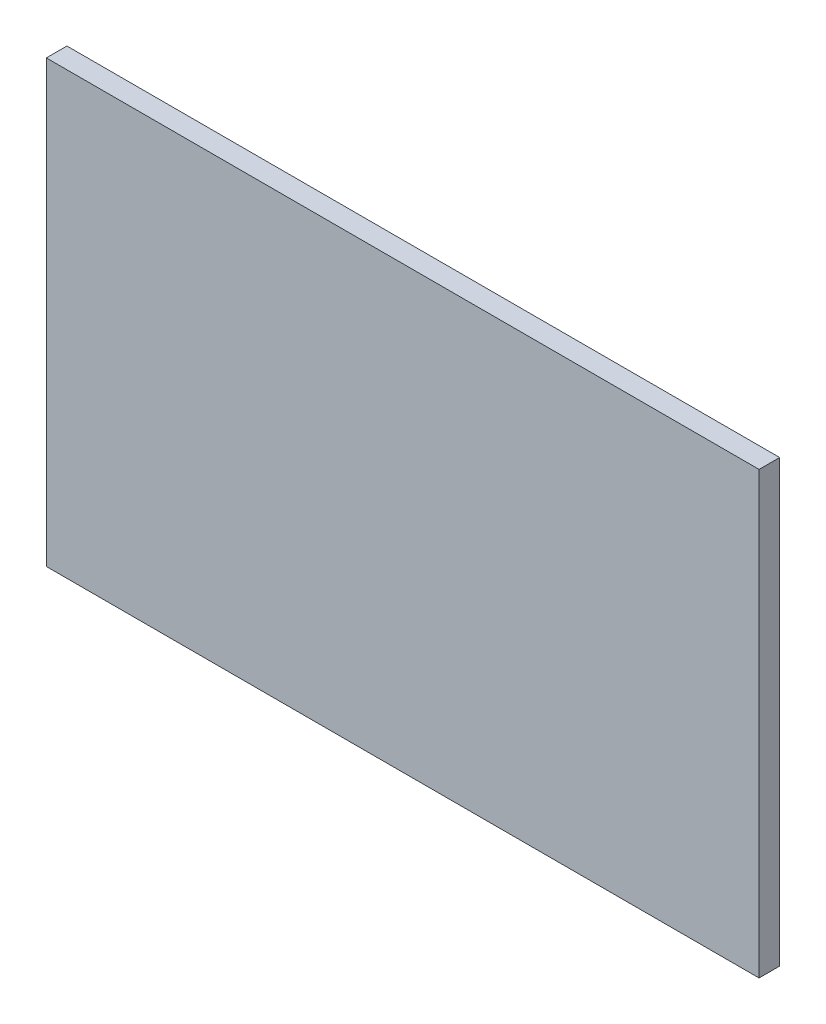
ISO-10303-21;
HEADER;
FILE_DESCRIPTION(('STEP AP214'),'2;1');
FILE_NAME('part.step','',(''),(''),'','','');
FILE_SCHEMA(('AUTOMOTIVE_DESIGN { 1 0 10303 214 1 1 1 1 }'));
ENDSEC;
DATA;
#1=APPLICATION_CONTEXT('core data for automotive mechanical design processes');
#2=APPLICATION_PROTOCOL_DEFINITION('international standard','automotive_design',2000,#1);
#3=PRODUCT_CONTEXT('',#1,'mechanical');
#4=PRODUCT('Part','Part','',(#3));
#5=PRODUCT_RELATED_PRODUCT_CATEGORY('part','',(#4));
#6=PRODUCT_DEFINITION_FORMATION('','',#4);
#7=PRODUCT_DEFINITION_CONTEXT('part definition',#1,'design');
#8=PRODUCT_DEFINITION('design','',#6,#7);
#9=PRODUCT_DEFINITION_SHAPE('','',#8);
#10=(LENGTH_UNIT() NAMED_UNIT(*) SI_UNIT(.MILLI.,.METRE.));
#11=(NAMED_UNIT(*) PLANE_ANGLE_UNIT() SI_UNIT($,.RADIAN.));
#12=(NAMED_UNIT(*) SI_UNIT($,.STERADIAN.) SOLID_ANGLE_UNIT());
#13=UNCERTAINTY_MEASURE_WITH_UNIT(LENGTH_MEASURE(1.E-05),#10,'distance_accuracy_value','');
#14=(GEOMETRIC_REPRESENTATION_CONTEXT(3) GLOBAL_UNCERTAINTY_ASSIGNED_CONTEXT((#13)) GLOBAL_UNIT_ASSIGNED_CONTEXT((#10,
#11,#12)) REPRESENTATION_CONTEXT('',''));
#15=CARTESIAN_POINT('',(0.,0.,0.));
#16=DIRECTION('',(0.,0.,1.));
#17=DIRECTION('',(1.,0.,0.));
#18=AXIS2_PLACEMENT_3D('',#15,#16,#17);
#19=CARTESIAN_POINT('',(-311.5,-192.5,18.));
#20=DIRECTION('',(1.,0.,0.));
#21=DIRECTION('',(0.,0.,-1.));
#22=AXIS2_PLACEMENT_3D('',#19,#20,#21);
#23=PLANE('',#22);
#24=DIRECTION('',(0.,-1.,0.));
#25=VECTOR('',#24,1.);
#26=CARTESIAN_POINT('',(-311.5,-192.5,0.));
#27=LINE('',#26,#25);
#28=CARTESIAN_POINT('',(-311.5,192.5,0.));
#29=VERTEX_POINT('',#28);
#30=CARTESIAN_POINT('',(-311.5,-192.5,0.));
#31=VERTEX_POINT('',#30);
#32=EDGE_CURVE('E96',#29,#31,#27,.T.);
#33=ORIENTED_EDGE('',*,*,#32,.T.);
#34=DIRECTION('',(0.,0.,-1.));
#35=VECTOR('',#34,1.);
#36=CARTESIAN_POINT('',(-311.5,-192.5,18.));
#37=LINE('',#36,#35);
#38=CARTESIAN_POINT('',(-311.5,-192.5,18.));
#39=VERTEX_POINT('',#38);
#40=EDGE_CURVE('E11',#39,#31,#37,.T.);
#41=ORIENTED_EDGE('',*,*,#40,.F.);
#42=DIRECTION('',(0.,-1.,0.));
#43=VECTOR('',#42,1.);
#44=CARTESIAN_POINT('',(-311.5,-192.5,18.));
#45=LINE('',#44,#43);
#46=CARTESIAN_POINT('',(-311.5,192.5,18.));
#47=VERTEX_POINT('',#46);
#48=EDGE_CURVE('E84',#47,#39,#45,.T.);
#49=ORIENTED_EDGE('',*,*,#48,.F.);
#50=DIRECTION('',(0.,0.,-1.));
#51=VECTOR('',#50,1.);
#52=CARTESIAN_POINT('',(-311.5,192.5,18.));
#53=LINE('',#52,#51);
#54=EDGE_CURVE('E92',#47,#29,#53,.T.);
#55=ORIENTED_EDGE('',*,*,#54,.T.);
#56=EDGE_LOOP('',(#33,#41,#49,#55));
#57=FACE_BOUND('',#56,.T.);
#58=ADVANCED_FACE('F33',(#57),#23,.F.);
#59=CARTESIAN_POINT('',(311.5,-192.5,18.));
#60=DIRECTION('',(0.,1.,0.));
#61=DIRECTION('',(-1.,0.,0.));
#62=AXIS2_PLACEMENT_3D('',#59,#60,#61);
#63=PLANE('',#62);
#64=DIRECTION('',(1.,0.,0.));
#65=VECTOR('',#64,1.);
#66=CARTESIAN_POINT('',(311.5,-192.5,0.));
#67=LINE('',#66,#65);
#68=CARTESIAN_POINT('',(311.5,-192.5,0.));
#69=VERTEX_POINT('',#68);
#70=EDGE_CURVE('E88',#31,#69,#67,.T.);
#71=ORIENTED_EDGE('',*,*,#70,.T.);
#72=DIRECTION('',(0.,0.,-1.));
#73=VECTOR('',#72,1.);
#74=CARTESIAN_POINT('',(311.5,-192.5,18.));
#75=LINE('',#74,#73);
#76=CARTESIAN_POINT('',(311.5,-192.5,18.));
#77=VERTEX_POINT('',#76);
#78=EDGE_CURVE('E41',#77,#69,#75,.T.);
#79=ORIENTED_EDGE('',*,*,#78,.F.);
#80=DIRECTION('',(1.,0.,0.));
#81=VECTOR('',#80,1.);
#82=CARTESIAN_POINT('',(311.5,-192.5,18.));
#83=LINE('',#82,#81);
#84=EDGE_CURVE('E79',#39,#77,#83,.T.);
#85=ORIENTED_EDGE('',*,*,#84,.F.);
#86=ORIENTED_EDGE('',*,*,#40,.T.);
#87=EDGE_LOOP('',(#71,#79,#85,#86));
#88=FACE_BOUND('',#87,.T.);
#89=ADVANCED_FACE('F87',(#88),#63,.F.);
#90=CARTESIAN_POINT('',(311.5,-192.5,18.));
#91=DIRECTION('',(-1.,0.,0.));
#92=DIRECTION('',(0.,0.,1.));
#93=AXIS2_PLACEMENT_3D('',#90,#91,#92);
#94=PLANE('',#93);
#95=DIRECTION('',(0.,1.,0.));
#96=VECTOR('',#95,1.);
#97=CARTESIAN_POINT('',(311.5,-192.5,0.));
#98=LINE('',#97,#96);
#99=CARTESIAN_POINT('',(311.5,192.5,0.));
#100=VERTEX_POINT('',#99);
#101=EDGE_CURVE('E66',#69,#100,#98,.T.);
#102=ORIENTED_EDGE('',*,*,#101,.T.);
#103=DIRECTION('',(0.,0.,-1.));
#104=VECTOR('',#103,1.);
#105=CARTESIAN_POINT('',(311.5,192.5,18.));
#106=LINE('',#105,#104);
#107=CARTESIAN_POINT('',(311.5,192.5,18.));
#108=VERTEX_POINT('',#107);
#109=EDGE_CURVE('E89',#108,#100,#106,.T.);
#110=ORIENTED_EDGE('',*,*,#109,.F.);
#111=DIRECTION('',(0.,1.,0.));
#112=VECTOR('',#111,1.);
#113=CARTESIAN_POINT('',(311.5,-192.5,18.));
#114=LINE('',#113,#112);
#115=EDGE_CURVE('E82',#77,#108,#114,.T.);
#116=ORIENTED_EDGE('',*,*,#115,.F.);
#117=ORIENTED_EDGE('',*,*,#78,.T.);
#118=EDGE_LOOP('',(#102,#110,#116,#117));
#119=FACE_BOUND('',#118,.T.);
#120=ADVANCED_FACE('F90',(#119),#94,.F.);
#121=CARTESIAN_POINT('',(311.5,192.5,18.));
#122=DIRECTION('',(0.,-1.,0.));
#123=DIRECTION('',(1.,0.,0.));
#124=AXIS2_PLACEMENT_3D('',#121,#122,#123);
#125=PLANE('',#124);
#126=DIRECTION('',(-1.,0.,0.));
#127=VECTOR('',#126,1.);
#128=CARTESIAN_POINT('',(311.5,192.5,0.));
#129=LINE('',#128,#127);
#130=EDGE_CURVE('E72',#100,#29,#129,.T.);
#131=ORIENTED_EDGE('',*,*,#130,.T.);
#132=ORIENTED_EDGE('',*,*,#54,.F.);
#133=DIRECTION('',(-1.,0.,0.));
#134=VECTOR('',#133,1.);
#135=CARTESIAN_POINT('',(311.5,192.5,18.));
#136=LINE('',#135,#134);
#137=EDGE_CURVE('E49',#108,#47,#136,.T.);
#138=ORIENTED_EDGE('',*,*,#137,.F.);
#139=ORIENTED_EDGE('',*,*,#109,.T.);
#140=EDGE_LOOP('',(#131,#132,#138,#139));
#141=FACE_BOUND('',#140,.T.);
#142=ADVANCED_FACE('F103',(#141),#125,.F.);
#143=CARTESIAN_POINT('',(0.,0.,18.));
#144=DIRECTION('',(0.,0.,1.));
#145=DIRECTION('',(1.,0.,0.));
#146=AXIS2_PLACEMENT_3D('',#143,#144,#145);
#147=PLANE('',#146);
#148=ORIENTED_EDGE('',*,*,#48,.T.);
#149=ORIENTED_EDGE('',*,*,#84,.T.);
#150=ORIENTED_EDGE('',*,*,#115,.T.);
#151=ORIENTED_EDGE('',*,*,#137,.T.);
#152=EDGE_LOOP('',(#148,#149,#150,#151));
#153=FACE_BOUND('',#152,.T.);
#154=ADVANCED_FACE('F80',(#153),#147,.T.);
#155=CARTESIAN_POINT('',(0.,0.,0.));
#156=DIRECTION('',(0.,0.,1.));
#157=DIRECTION('',(1.,0.,0.));
#158=AXIS2_PLACEMENT_3D('',#155,#156,#157);
#159=PLANE('',#158);
#160=ORIENTED_EDGE('',*,*,#32,.F.);
#161=ORIENTED_EDGE('',*,*,#130,.F.);
#162=ORIENTED_EDGE('',*,*,#101,.F.);
#163=ORIENTED_EDGE('',*,*,#70,.F.);
#164=EDGE_LOOP('',(#160,#161,#162,#163));
#165=FACE_BOUND('',#164,.T.);
#166=ADVANCED_FACE('F106',(#165),#159,.F.);
#167=CLOSED_SHELL('',(#58,#89,#120,#142,#154,#166));
#168=MANIFOLD_SOLID_BREP('B2',#167);
#169=ADVANCED_BREP_SHAPE_REPRESENTATION('',(#18,#168),#14);
#170=SHAPE_DEFINITION_REPRESENTATION(#9,#169);
ENDSEC;
END-ISO-10303-21;
